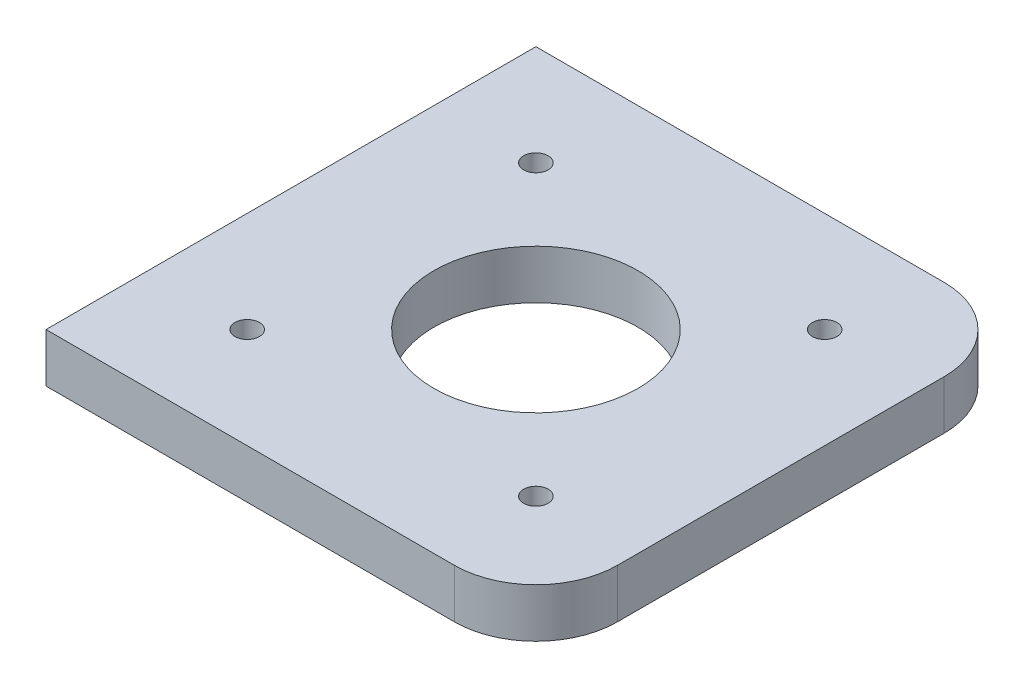
ISO-10303-21;
HEADER;
FILE_DESCRIPTION(('STEP AP214'),'2;1');
FILE_NAME('part.step','',(''),(''),'','','');
FILE_SCHEMA(('AUTOMOTIVE_DESIGN { 1 0 10303 214 1 1 1 1 }'));
ENDSEC;
DATA;
#1=APPLICATION_CONTEXT('core data for automotive mechanical design processes');
#2=APPLICATION_PROTOCOL_DEFINITION('international standard','automotive_design',2000,#1);
#3=PRODUCT_CONTEXT('',#1,'mechanical');
#4=PRODUCT('Part','Part','',(#3));
#5=PRODUCT_RELATED_PRODUCT_CATEGORY('part','',(#4));
#6=PRODUCT_DEFINITION_FORMATION('','',#4);
#7=PRODUCT_DEFINITION_CONTEXT('part definition',#1,'design');
#8=PRODUCT_DEFINITION('design','',#6,#7);
#9=PRODUCT_DEFINITION_SHAPE('','',#8);
#10=(LENGTH_UNIT() NAMED_UNIT(*) SI_UNIT(.MILLI.,.METRE.));
#11=(NAMED_UNIT(*) PLANE_ANGLE_UNIT() SI_UNIT($,.RADIAN.));
#12=(NAMED_UNIT(*) SI_UNIT($,.STERADIAN.) SOLID_ANGLE_UNIT());
#13=UNCERTAINTY_MEASURE_WITH_UNIT(LENGTH_MEASURE(1.E-05),#10,'distance_accuracy_value','');
#14=(GEOMETRIC_REPRESENTATION_CONTEXT(3) GLOBAL_UNCERTAINTY_ASSIGNED_CONTEXT((#13)) GLOBAL_UNIT_ASSIGNED_CONTEXT((#10,
#11,#12)) REPRESENTATION_CONTEXT('',''));
#15=CARTESIAN_POINT('',(0.,0.,0.));
#16=DIRECTION('',(0.,0.,1.));
#17=DIRECTION('',(1.,0.,0.));
#18=AXIS2_PLACEMENT_3D('',#15,#16,#17);
#19=CARTESIAN_POINT('',(-112.370135213942,25.5,114.92));
#20=DIRECTION('',(0.,1.,0.));
#21=DIRECTION('',(0.,0.,1.));
#22=AXIS2_PLACEMENT_3D('',#19,#20,#21);
#23=PLANE('',#22);
#24=CARTESIAN_POINT('',(-112.370135213942,25.5,114.92));
#25=DIRECTION('',(0.,1.,0.));
#26=DIRECTION('',(0.,0.,1.));
#27=AXIS2_PLACEMENT_3D('',#24,#25,#26);
#28=CIRCLE('',#27,11.25);
#29=CARTESIAN_POINT('',(-112.370135213942,25.5,126.17));
#30=VERTEX_POINT('',#29);
#31=EDGE_CURVE('E299',#30,#30,#28,.T.);
#32=ORIENTED_EDGE('',*,*,#31,.F.);
#33=EDGE_LOOP('',(#32));
#34=FACE_BOUND('',#33,.T.);
#35=CARTESIAN_POINT('',(152.829864786058,25.5,-150.28));
#36=DIRECTION('',(0.,1.,0.));
#37=DIRECTION('',(0.,0.,1.));
#38=AXIS2_PLACEMENT_3D('',#35,#36,#37);
#39=CIRCLE('',#38,11.25);
#40=CARTESIAN_POINT('',(152.829864786058,25.5,-139.03));
#41=VERTEX_POINT('',#40);
#42=EDGE_CURVE('E315',#41,#41,#39,.T.);
#43=ORIENTED_EDGE('',*,*,#42,.F.);
#44=EDGE_LOOP('',(#43));
#45=FACE_BOUND('',#44,.T.);
#46=DIRECTION('',(1.,0.,0.));
#47=VECTOR('',#46,1.);
#48=CARTESIAN_POINT('',(-204.770135213942,25.5,207.32));
#49=LINE('',#48,#47);
#50=CARTESIAN_POINT('',(-204.770135213942,25.5,207.32));
#51=VERTEX_POINT('',#50);
#52=CARTESIAN_POINT('',(170.229864786058,25.5,207.32));
#53=VERTEX_POINT('',#52);
#54=EDGE_CURVE('E93',#51,#53,#49,.T.);
#55=ORIENTED_EDGE('',*,*,#54,.T.);
#56=CARTESIAN_POINT('',(170.229864786058,25.5,132.32));
#57=DIRECTION('',(0.,1.,0.));
#58=DIRECTION('',(0.,0.,1.));
#59=AXIS2_PLACEMENT_3D('',#56,#57,#58);
#60=CIRCLE('',#59,75.);
#61=CARTESIAN_POINT('',(245.229864786058,25.5,132.32));
#62=VERTEX_POINT('',#61);
#63=EDGE_CURVE('E48',#53,#62,#60,.T.);
#64=ORIENTED_EDGE('',*,*,#63,.T.);
#65=DIRECTION('',(0.,0.,-1.));
#66=VECTOR('',#65,1.);
#67=CARTESIAN_POINT('',(245.229864786059,25.5,-242.68));
#68=LINE('',#67,#66);
#69=CARTESIAN_POINT('',(245.229864786059,25.5,-167.68));
#70=VERTEX_POINT('',#69);
#71=EDGE_CURVE('E101',#62,#70,#68,.T.);
#72=ORIENTED_EDGE('',*,*,#71,.T.);
#73=CARTESIAN_POINT('',(170.229864786058,25.5,-167.68));
#74=DIRECTION('',(0.,1.,0.));
#75=DIRECTION('',(0.,0.,1.));
#76=AXIS2_PLACEMENT_3D('',#73,#74,#75);
#77=CIRCLE('',#76,75.);
#78=CARTESIAN_POINT('',(170.229864786058,25.5,-242.68));
#79=VERTEX_POINT('',#78);
#80=EDGE_CURVE('E55',#70,#79,#77,.T.);
#81=ORIENTED_EDGE('',*,*,#80,.T.);
#82=DIRECTION('',(-1.,0.,0.));
#83=VECTOR('',#82,1.);
#84=CARTESIAN_POINT('',(-204.770135213942,25.5,-242.68));
#85=LINE('',#84,#83);
#86=CARTESIAN_POINT('',(-204.770135213942,25.5,-242.68));
#87=VERTEX_POINT('',#86);
#88=EDGE_CURVE('E106',#79,#87,#85,.T.);
#89=ORIENTED_EDGE('',*,*,#88,.T.);
#90=DIRECTION('',(0.,0.,1.));
#91=VECTOR('',#90,1.);
#92=CARTESIAN_POINT('',(-204.770135213942,25.5,-242.68));
#93=LINE('',#92,#91);
#94=EDGE_CURVE('E102',#87,#51,#93,.T.);
#95=ORIENTED_EDGE('',*,*,#94,.T.);
#96=EDGE_LOOP('',(#55,#64,#72,#81,#89,#95));
#97=FACE_BOUND('',#96,.T.);
#98=CARTESIAN_POINT('',(-112.370135213942,25.5,-150.28));
#99=DIRECTION('',(0.,1.,0.));
#100=DIRECTION('',(0.,0.,1.));
#101=AXIS2_PLACEMENT_3D('',#98,#99,#100);
#102=CIRCLE('',#101,11.25);
#103=CARTESIAN_POINT('',(-112.370135213942,25.5,-139.03));
#104=VERTEX_POINT('',#103);
#105=EDGE_CURVE('E161',#104,#104,#102,.T.);
#106=ORIENTED_EDGE('',*,*,#105,.F.);
#107=EDGE_LOOP('',(#106));
#108=FACE_BOUND('',#107,.T.);
#109=CARTESIAN_POINT('',(152.829864786058,25.5,114.92));
#110=DIRECTION('',(0.,1.,0.));
#111=DIRECTION('',(0.,0.,1.));
#112=AXIS2_PLACEMENT_3D('',#109,#110,#111);
#113=CIRCLE('',#112,11.25);
#114=CARTESIAN_POINT('',(152.829864786058,25.5,126.17));
#115=VERTEX_POINT('',#114);
#116=EDGE_CURVE('E307',#115,#115,#113,.T.);
#117=ORIENTED_EDGE('',*,*,#116,.F.);
#118=EDGE_LOOP('',(#117));
#119=FACE_BOUND('',#118,.T.);
#120=CARTESIAN_POINT('',(20.2298647860584,25.5,-17.6800000000001));
#121=DIRECTION('',(0.,1.,0.));
#122=DIRECTION('',(0.,0.,1.));
#123=AXIS2_PLACEMENT_3D('',#120,#121,#122);
#124=CIRCLE('',#123,93.75);
#125=CARTESIAN_POINT('',(20.2298647860584,25.5,76.0699999999999));
#126=VERTEX_POINT('',#125);
#127=EDGE_CURVE('E288',#126,#126,#124,.T.);
#128=ORIENTED_EDGE('',*,*,#127,.F.);
#129=EDGE_LOOP('',(#128));
#130=FACE_BOUND('',#129,.T.);
#131=ADVANCED_FACE('F39',(#34,#45,#97,#108,#119,#130),#23,.T.);
#132=CARTESIAN_POINT('',(-112.370135213942,-19.5,114.92));
#133=DIRECTION('',(0.,1.,0.));
#134=DIRECTION('',(0.,0.,1.));
#135=AXIS2_PLACEMENT_3D('',#132,#133,#134);
#136=PLANE('',#135);
#137=DIRECTION('',(0.,0.,-1.));
#138=VECTOR('',#137,1.);
#139=CARTESIAN_POINT('',(245.229864786059,-19.5,-242.68));
#140=LINE('',#139,#138);
#141=CARTESIAN_POINT('',(245.229864786058,-19.5,132.32));
#142=VERTEX_POINT('',#141);
#143=CARTESIAN_POINT('',(245.229864786059,-19.5,-167.68));
#144=VERTEX_POINT('',#143);
#145=EDGE_CURVE('E155',#142,#144,#140,.T.);
#146=ORIENTED_EDGE('',*,*,#145,.F.);
#147=CARTESIAN_POINT('',(170.229864786058,-19.5,132.32));
#148=DIRECTION('',(0.,1.,0.));
#149=DIRECTION('',(0.,0.,1.));
#150=AXIS2_PLACEMENT_3D('',#147,#148,#149);
#151=CIRCLE('',#150,75.);
#152=CARTESIAN_POINT('',(170.229864786058,-19.5,207.32));
#153=VERTEX_POINT('',#152);
#154=EDGE_CURVE('E133',#142,#153,#151,.F.);
#155=ORIENTED_EDGE('',*,*,#154,.T.);
#156=DIRECTION('',(1.,0.,0.));
#157=VECTOR('',#156,1.);
#158=CARTESIAN_POINT('',(-204.770135213942,-19.5,207.32));
#159=LINE('',#158,#157);
#160=CARTESIAN_POINT('',(-204.770135213942,-19.5,207.32));
#161=VERTEX_POINT('',#160);
#162=EDGE_CURVE('E154',#161,#153,#159,.T.);
#163=ORIENTED_EDGE('',*,*,#162,.F.);
#164=DIRECTION('',(0.,0.,1.));
#165=VECTOR('',#164,1.);
#166=CARTESIAN_POINT('',(-204.770135213942,-19.5,-242.68));
#167=LINE('',#166,#165);
#168=CARTESIAN_POINT('',(-204.770135213942,-19.5,-242.68));
#169=VERTEX_POINT('',#168);
#170=EDGE_CURVE('E115',#169,#161,#167,.T.);
#171=ORIENTED_EDGE('',*,*,#170,.F.);
#172=DIRECTION('',(-1.,0.,0.));
#173=VECTOR('',#172,1.);
#174=CARTESIAN_POINT('',(-204.770135213942,-19.5,-242.68));
#175=LINE('',#174,#173);
#176=CARTESIAN_POINT('',(170.229864786058,-19.5,-242.68));
#177=VERTEX_POINT('',#176);
#178=EDGE_CURVE('E111',#177,#169,#175,.T.);
#179=ORIENTED_EDGE('',*,*,#178,.F.);
#180=CARTESIAN_POINT('',(170.229864786058,-19.5,-167.68));
#181=DIRECTION('',(0.,1.,0.));
#182=DIRECTION('',(0.,0.,1.));
#183=AXIS2_PLACEMENT_3D('',#180,#181,#182);
#184=CIRCLE('',#183,75.);
#185=EDGE_CURVE('E130',#177,#144,#184,.F.);
#186=ORIENTED_EDGE('',*,*,#185,.T.);
#187=EDGE_LOOP('',(#146,#155,#163,#171,#179,#186));
#188=FACE_BOUND('',#187,.T.);
#189=CARTESIAN_POINT('',(-112.370135213942,-19.5,-150.28));
#190=DIRECTION('',(0.,1.,0.));
#191=DIRECTION('',(0.,0.,1.));
#192=AXIS2_PLACEMENT_3D('',#189,#190,#191);
#193=CIRCLE('',#192,11.25);
#194=CARTESIAN_POINT('',(-112.370135213942,-19.5,-139.03));
#195=VERTEX_POINT('',#194);
#196=EDGE_CURVE('E319',#195,#195,#193,.T.);
#197=ORIENTED_EDGE('',*,*,#196,.T.);
#198=EDGE_LOOP('',(#197));
#199=FACE_BOUND('',#198,.T.);
#200=CARTESIAN_POINT('',(152.829864786058,-19.5,-150.28));
#201=DIRECTION('',(0.,1.,0.));
#202=DIRECTION('',(0.,0.,1.));
#203=AXIS2_PLACEMENT_3D('',#200,#201,#202);
#204=CIRCLE('',#203,11.25);
#205=CARTESIAN_POINT('',(152.829864786058,-19.5,-139.03));
#206=VERTEX_POINT('',#205);
#207=EDGE_CURVE('E311',#206,#206,#204,.T.);
#208=ORIENTED_EDGE('',*,*,#207,.T.);
#209=EDGE_LOOP('',(#208));
#210=FACE_BOUND('',#209,.T.);
#211=CARTESIAN_POINT('',(152.829864786058,-19.5,114.92));
#212=DIRECTION('',(0.,1.,0.));
#213=DIRECTION('',(0.,0.,1.));
#214=AXIS2_PLACEMENT_3D('',#211,#212,#213);
#215=CIRCLE('',#214,11.25);
#216=CARTESIAN_POINT('',(152.829864786058,-19.5,126.17));
#217=VERTEX_POINT('',#216);
#218=EDGE_CURVE('E303',#217,#217,#215,.T.);
#219=ORIENTED_EDGE('',*,*,#218,.T.);
#220=EDGE_LOOP('',(#219));
#221=FACE_BOUND('',#220,.T.);
#222=CARTESIAN_POINT('',(-112.370135213942,-19.5,114.92));
#223=DIRECTION('',(0.,1.,0.));
#224=DIRECTION('',(0.,0.,1.));
#225=AXIS2_PLACEMENT_3D('',#222,#223,#224);
#226=CIRCLE('',#225,11.25);
#227=CARTESIAN_POINT('',(-112.370135213942,-19.5,126.17));
#228=VERTEX_POINT('',#227);
#229=EDGE_CURVE('E296',#228,#228,#226,.T.);
#230=ORIENTED_EDGE('',*,*,#229,.T.);
#231=EDGE_LOOP('',(#230));
#232=FACE_BOUND('',#231,.T.);
#233=CARTESIAN_POINT('',(20.2298647860584,-19.5,-17.6800000000001));
#234=DIRECTION('',(0.,1.,0.));
#235=DIRECTION('',(0.,0.,1.));
#236=AXIS2_PLACEMENT_3D('',#233,#234,#235);
#237=CIRCLE('',#236,93.75);
#238=CARTESIAN_POINT('',(20.2298647860584,-19.5,76.0699999999999));
#239=VERTEX_POINT('',#238);
#240=EDGE_CURVE('E291',#239,#239,#237,.T.);
#241=ORIENTED_EDGE('',*,*,#240,.T.);
#242=EDGE_LOOP('',(#241));
#243=FACE_BOUND('',#242,.T.);
#244=ADVANCED_FACE('F152',(#188,#199,#210,#221,#232,#243),#136,.F.);
#245=CARTESIAN_POINT('',(-204.770135213942,25.5,-242.68));
#246=DIRECTION('',(1.,0.,0.));
#247=DIRECTION('',(0.,0.,-1.));
#248=AXIS2_PLACEMENT_3D('',#245,#246,#247);
#249=PLANE('',#248);
#250=ORIENTED_EDGE('',*,*,#170,.T.);
#251=DIRECTION('',(0.,-1.,0.));
#252=VECTOR('',#251,1.);
#253=CARTESIAN_POINT('',(-204.770135213942,25.5,207.32));
#254=LINE('',#253,#252);
#255=EDGE_CURVE('E97',#51,#161,#254,.T.);
#256=ORIENTED_EDGE('',*,*,#255,.F.);
#257=ORIENTED_EDGE('',*,*,#94,.F.);
#258=DIRECTION('',(0.,-1.,0.));
#259=VECTOR('',#258,1.);
#260=CARTESIAN_POINT('',(-204.770135213942,25.5,-242.68));
#261=LINE('',#260,#259);
#262=EDGE_CURVE('E118',#87,#169,#261,.T.);
#263=ORIENTED_EDGE('',*,*,#262,.T.);
#264=EDGE_LOOP('',(#250,#256,#257,#263));
#265=FACE_BOUND('',#264,.T.);
#266=ADVANCED_FACE('F113',(#265),#249,.F.);
#267=CARTESIAN_POINT('',(-204.770135213942,25.5,207.32));
#268=DIRECTION('',(0.,0.,-1.));
#269=DIRECTION('',(-1.,0.,0.));
#270=AXIS2_PLACEMENT_3D('',#267,#268,#269);
#271=PLANE('',#270);
#272=ORIENTED_EDGE('',*,*,#162,.T.);
#273=DIRECTION('',(0.,-1.,0.));
#274=VECTOR('',#273,1.);
#275=CARTESIAN_POINT('',(170.229864786058,25.5,207.32));
#276=LINE('',#275,#274);
#277=EDGE_CURVE('E63',#153,#53,#276,.F.);
#278=ORIENTED_EDGE('',*,*,#277,.T.);
#279=ORIENTED_EDGE('',*,*,#54,.F.);
#280=ORIENTED_EDGE('',*,*,#255,.T.);
#281=EDGE_LOOP('',(#272,#278,#279,#280));
#282=FACE_BOUND('',#281,.T.);
#283=ADVANCED_FACE('F95',(#282),#271,.F.);
#284=CARTESIAN_POINT('',(245.229864786059,25.5,-242.68));
#285=DIRECTION('',(-1.,0.,0.));
#286=DIRECTION('',(0.,0.,1.));
#287=AXIS2_PLACEMENT_3D('',#284,#285,#286);
#288=PLANE('',#287);
#289=ORIENTED_EDGE('',*,*,#71,.F.);
#290=DIRECTION('',(0.,-1.,0.));
#291=VECTOR('',#290,1.);
#292=CARTESIAN_POINT('',(245.229864786058,25.5,132.32));
#293=LINE('',#292,#291);
#294=EDGE_CURVE('E122',#62,#142,#293,.T.);
#295=ORIENTED_EDGE('',*,*,#294,.T.);
#296=ORIENTED_EDGE('',*,*,#145,.T.);
#297=DIRECTION('',(0.,-1.,0.));
#298=VECTOR('',#297,1.);
#299=CARTESIAN_POINT('',(245.229864786059,25.5,-167.68));
#300=LINE('',#299,#298);
#301=EDGE_CURVE('E117',#144,#70,#300,.F.);
#302=ORIENTED_EDGE('',*,*,#301,.T.);
#303=EDGE_LOOP('',(#289,#295,#296,#302));
#304=FACE_BOUND('',#303,.T.);
#305=ADVANCED_FACE('F144',(#304),#288,.F.);
#306=CARTESIAN_POINT('',(-204.770135213942,25.5,-242.68));
#307=DIRECTION('',(0.,0.,1.));
#308=DIRECTION('',(1.,0.,0.));
#309=AXIS2_PLACEMENT_3D('',#306,#307,#308);
#310=PLANE('',#309);
#311=ORIENTED_EDGE('',*,*,#88,.F.);
#312=DIRECTION('',(0.,-1.,0.));
#313=VECTOR('',#312,1.);
#314=CARTESIAN_POINT('',(170.229864786058,25.5,-242.68));
#315=LINE('',#314,#313);
#316=EDGE_CURVE('E11',#79,#177,#315,.T.);
#317=ORIENTED_EDGE('',*,*,#316,.T.);
#318=ORIENTED_EDGE('',*,*,#178,.T.);
#319=ORIENTED_EDGE('',*,*,#262,.F.);
#320=EDGE_LOOP('',(#311,#317,#318,#319));
#321=FACE_BOUND('',#320,.T.);
#322=ADVANCED_FACE('F167',(#321),#310,.F.);
#323=CARTESIAN_POINT('',(-112.370135213942,25.5,-150.28));
#324=DIRECTION('',(0.,-1.,0.));
#325=DIRECTION('',(0.,0.,-1.));
#326=AXIS2_PLACEMENT_3D('',#323,#324,#325);
#327=CYLINDRICAL_SURFACE('',#326,11.25);
#328=ORIENTED_EDGE('',*,*,#105,.T.);
#329=EDGE_LOOP('',(#328));
#330=FACE_BOUND('',#329,.T.);
#331=ORIENTED_EDGE('',*,*,#196,.F.);
#332=EDGE_LOOP('',(#331));
#333=FACE_BOUND('',#332,.T.);
#334=ADVANCED_FACE('F185',(#330,#333),#327,.F.);
#335=CARTESIAN_POINT('',(152.829864786058,25.5,-150.28));
#336=DIRECTION('',(0.,-1.,0.));
#337=DIRECTION('',(0.,0.,-1.));
#338=AXIS2_PLACEMENT_3D('',#335,#336,#337);
#339=CYLINDRICAL_SURFACE('',#338,11.25);
#340=ORIENTED_EDGE('',*,*,#42,.T.);
#341=EDGE_LOOP('',(#340));
#342=FACE_BOUND('',#341,.T.);
#343=ORIENTED_EDGE('',*,*,#207,.F.);
#344=EDGE_LOOP('',(#343));
#345=FACE_BOUND('',#344,.T.);
#346=ADVANCED_FACE('F217',(#342,#345),#339,.F.);
#347=CARTESIAN_POINT('',(152.829864786058,25.5,114.92));
#348=DIRECTION('',(0.,-1.,0.));
#349=DIRECTION('',(0.,0.,-1.));
#350=AXIS2_PLACEMENT_3D('',#347,#348,#349);
#351=CYLINDRICAL_SURFACE('',#350,11.25);
#352=ORIENTED_EDGE('',*,*,#116,.T.);
#353=EDGE_LOOP('',(#352));
#354=FACE_BOUND('',#353,.T.);
#355=ORIENTED_EDGE('',*,*,#218,.F.);
#356=EDGE_LOOP('',(#355));
#357=FACE_BOUND('',#356,.T.);
#358=ADVANCED_FACE('F224',(#354,#357),#351,.F.);
#359=CARTESIAN_POINT('',(-112.370135213942,25.5,114.92));
#360=DIRECTION('',(0.,-1.,0.));
#361=DIRECTION('',(0.,0.,-1.));
#362=AXIS2_PLACEMENT_3D('',#359,#360,#361);
#363=CYLINDRICAL_SURFACE('',#362,11.25);
#364=ORIENTED_EDGE('',*,*,#31,.T.);
#365=EDGE_LOOP('',(#364));
#366=FACE_BOUND('',#365,.T.);
#367=ORIENTED_EDGE('',*,*,#229,.F.);
#368=EDGE_LOOP('',(#367));
#369=FACE_BOUND('',#368,.T.);
#370=ADVANCED_FACE('F231',(#366,#369),#363,.F.);
#371=CARTESIAN_POINT('',(20.2298647860584,25.5,-17.6800000000001));
#372=DIRECTION('',(0.,-1.,0.));
#373=DIRECTION('',(0.,0.,-1.));
#374=AXIS2_PLACEMENT_3D('',#371,#372,#373);
#375=CYLINDRICAL_SURFACE('',#374,93.75);
#376=ORIENTED_EDGE('',*,*,#127,.T.);
#377=EDGE_LOOP('',(#376));
#378=FACE_BOUND('',#377,.T.);
#379=ORIENTED_EDGE('',*,*,#240,.F.);
#380=EDGE_LOOP('',(#379));
#381=FACE_BOUND('',#380,.T.);
#382=ADVANCED_FACE('F174',(#378,#381),#375,.F.);
#383=CARTESIAN_POINT('',(170.229864786058,25.5,132.32));
#384=DIRECTION('',(0.,-1.,0.));
#385=DIRECTION('',(0.,0.,-1.));
#386=AXIS2_PLACEMENT_3D('',#383,#384,#385);
#387=CYLINDRICAL_SURFACE('',#386,75.);
#388=ORIENTED_EDGE('',*,*,#63,.F.);
#389=ORIENTED_EDGE('',*,*,#277,.F.);
#390=ORIENTED_EDGE('',*,*,#154,.F.);
#391=ORIENTED_EDGE('',*,*,#294,.F.);
#392=EDGE_LOOP('',(#388,#389,#390,#391));
#393=FACE_BOUND('',#392,.T.);
#394=ADVANCED_FACE('F150',(#393),#387,.T.);
#395=CARTESIAN_POINT('',(170.229864786058,25.5,-167.68));
#396=DIRECTION('',(0.,-1.,0.));
#397=DIRECTION('',(0.,0.,-1.));
#398=AXIS2_PLACEMENT_3D('',#395,#396,#397);
#399=CYLINDRICAL_SURFACE('',#398,75.);
#400=ORIENTED_EDGE('',*,*,#80,.F.);
#401=ORIENTED_EDGE('',*,*,#301,.F.);
#402=ORIENTED_EDGE('',*,*,#185,.F.);
#403=ORIENTED_EDGE('',*,*,#316,.F.);
#404=EDGE_LOOP('',(#400,#401,#402,#403));
#405=FACE_BOUND('',#404,.T.);
#406=ADVANCED_FACE('F41',(#405),#399,.T.);
#407=CLOSED_SHELL('',(#131,#244,#266,#283,#305,#322,#334,#346,#358,#370,#382,#394,#406));
#408=MANIFOLD_SOLID_BREP('B2',#407);
#409=ADVANCED_BREP_SHAPE_REPRESENTATION('',(#18,#408),#14);
#410=SHAPE_DEFINITION_REPRESENTATION(#9,#409);
ENDSEC;
END-ISO-10303-21;
